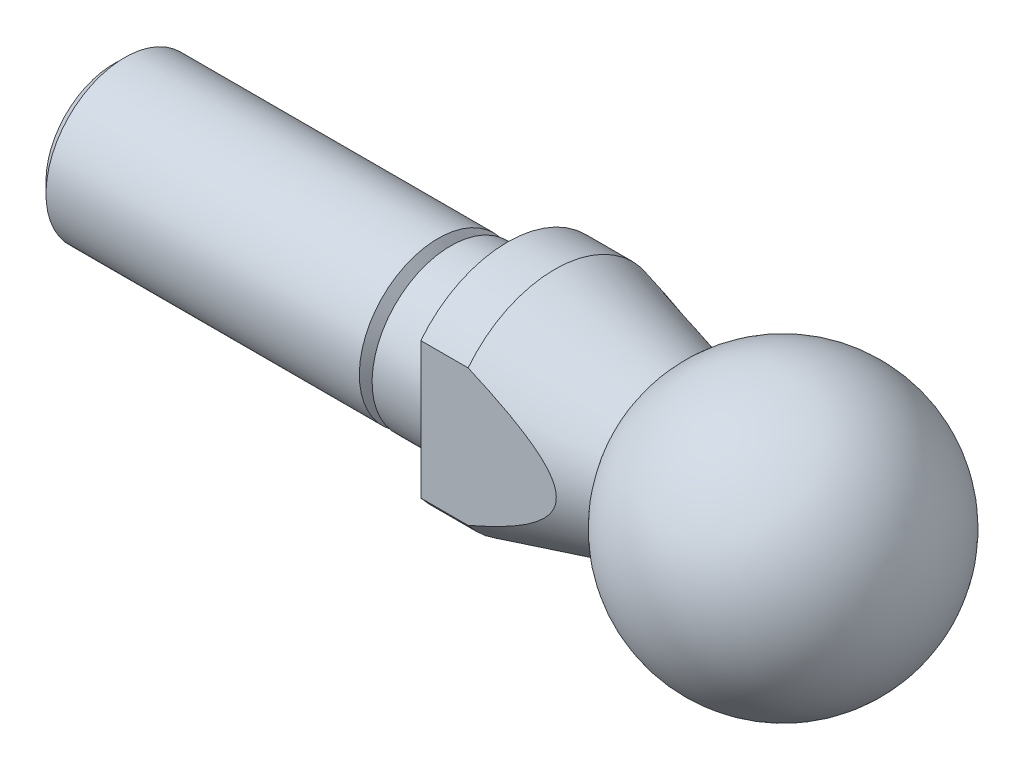
ISO-10303-21;
HEADER;
FILE_DESCRIPTION(('STEP AP214'),'2;1');
FILE_NAME('part.step','',(''),(''),'','','');
FILE_SCHEMA(('AUTOMOTIVE_DESIGN { 1 0 10303 214 1 1 1 1 }'));
ENDSEC;
DATA;
#1=APPLICATION_CONTEXT('core data for automotive mechanical design processes');
#2=APPLICATION_PROTOCOL_DEFINITION('international standard','automotive_design',2000,#1);
#3=PRODUCT_CONTEXT('',#1,'mechanical');
#4=PRODUCT('Part','Part','',(#3));
#5=PRODUCT_RELATED_PRODUCT_CATEGORY('part','',(#4));
#6=PRODUCT_DEFINITION_FORMATION('','',#4);
#7=PRODUCT_DEFINITION_CONTEXT('part definition',#1,'design');
#8=PRODUCT_DEFINITION('design','',#6,#7);
#9=PRODUCT_DEFINITION_SHAPE('','',#8);
#10=(LENGTH_UNIT() NAMED_UNIT(*) SI_UNIT(.MILLI.,.METRE.));
#11=(NAMED_UNIT(*) PLANE_ANGLE_UNIT() SI_UNIT($,.RADIAN.));
#12=(NAMED_UNIT(*) SI_UNIT($,.STERADIAN.) SOLID_ANGLE_UNIT());
#13=UNCERTAINTY_MEASURE_WITH_UNIT(LENGTH_MEASURE(1.E-05),#10,'distance_accuracy_value','');
#14=(GEOMETRIC_REPRESENTATION_CONTEXT(3) GLOBAL_UNCERTAINTY_ASSIGNED_CONTEXT((#13)) GLOBAL_UNIT_ASSIGNED_CONTEXT((#10,
#11,#12)) REPRESENTATION_CONTEXT('',''));
#15=CARTESIAN_POINT('',(0.,0.,0.));
#16=DIRECTION('',(0.,0.,1.));
#17=DIRECTION('',(1.,0.,0.));
#18=AXIS2_PLACEMENT_3D('',#15,#16,#17);
#19=CARTESIAN_POINT('',(-7.15784102046485,0.,0.));
#20=DIRECTION('',(-1.,0.,0.));
#21=DIRECTION('',(0.,-1.,0.));
#22=AXIS2_PLACEMENT_3D('',#19,#20,#21);
#23=CONICAL_SURFACE('',#22,5.03267443073269,0.261799387799143);
#24=CARTESIAN_POINT('',(-7.15784102046485,0.,0.));
#25=DIRECTION('',(-1.,0.,0.));
#26=DIRECTION('',(0.,-1.,0.));
#27=AXIS2_PLACEMENT_3D('',#24,#25,#26);
#28=CIRCLE('',#27,5.03267443073269);
#29=CARTESIAN_POINT('',(-7.15784102046485,-5.03267443073269,0.));
#30=VERTEX_POINT('',#29);
#31=EDGE_CURVE('E89',#30,#30,#28,.T.);
#32=ORIENTED_EDGE('',*,*,#31,.T.);
#33=EDGE_LOOP('',(#32));
#34=FACE_BOUND('',#33,.T.);
#35=CARTESIAN_POINT('',(-30.3086565496056,-9.7977459318579,5.5));
#36=CARTESIAN_POINT('',(-29.6572733564107,-9.59755580635371,5.5));
#37=CARTESIAN_POINT('',(-29.0062819363358,-9.39607938292667,5.5));
#38=CARTESIAN_POINT('',(-27.7052564749515,-8.98986114258725,5.5));
#39=CARTESIAN_POINT('',(-27.0552225228895,-8.78511904001088,5.5));
#40=CARTESIAN_POINT('',(-25.7533359999431,-8.3707362104608,5.5));
#41=CARTESIAN_POINT('',(-25.1014893221234,-8.16107692658439,5.5));
#42=CARTESIAN_POINT('',(-23.799451161882,-7.73682458402449,5.5));
#43=CARTESIAN_POINT('',(-23.1492595711958,-7.52223185777087,5.5));
#44=CARTESIAN_POINT('',(-21.7341338990989,-7.04760138951555,5.5));
#45=CARTESIAN_POINT('',(-20.9696089970535,-6.78633544809235,5.5));
#46=CARTESIAN_POINT('',(-19.8258981480734,-6.38536345586967,5.5));
#47=CARTESIAN_POINT('',(-19.4451276461648,-6.25017688510703,5.5));
#48=CARTESIAN_POINT('',(-18.6848985052808,-5.97616836588721,5.5));
#49=CARTESIAN_POINT('',(-18.3054398522372,-5.83734645655277,5.5));
#50=CARTESIAN_POINT('',(-17.5493340310696,-5.55572393081798,5.5));
#51=CARTESIAN_POINT('',(-17.172681797699,-5.41293694311487,5.5));
#52=CARTESIAN_POINT('',(-16.4214832528,-5.12193119902634,5.5));
#53=CARTESIAN_POINT('',(-16.0469368935971,-4.97371256618267,5.5));
#54=CARTESIAN_POINT('',(-15.3007840511043,-4.67044043180432,5.5));
#55=CARTESIAN_POINT('',(-14.9291764745641,-4.51538962804139,5.5));
#56=CARTESIAN_POINT('',(-14.1898430093052,-4.19632489403113,5.5));
#57=CARTESIAN_POINT('',(-13.8221166448905,-4.03231207778701,5.5));
#58=CARTESIAN_POINT('',(-13.2847752326486,-3.78175291075826,5.5));
#59=CARTESIAN_POINT('',(-13.1129421773135,-3.69996224203946,5.5));
#60=CARTESIAN_POINT('',(-12.7708422708496,-3.53312532321585,5.5));
#61=CARTESIAN_POINT('',(-12.6005755387882,-3.44807882810782,5.5));
#62=CARTESIAN_POINT('',(-12.261434471099,-3.27380954059523,5.5));
#63=CARTESIAN_POINT('',(-12.0925670694771,-3.18457320784866,5.5));
#64=CARTESIAN_POINT('',(-11.7574359359676,-3.00137672886827,5.5));
#65=CARTESIAN_POINT('',(-11.5911717875321,-2.90741734871449,5.5));
#66=CARTESIAN_POINT('',(-11.2660941217062,-2.71599680943488,5.5));
#67=CARTESIAN_POINT('',(-11.1071977963383,-2.6186770382101,5.5));
#68=CARTESIAN_POINT('',(-10.7939298291646,-2.41702413012211,5.5));
#69=CARTESIAN_POINT('',(-10.6395569882404,-2.31269287651365,5.5));
#70=CARTESIAN_POINT('',(-10.3380392975269,-2.09548825687512,5.5));
#71=CARTESIAN_POINT('',(-10.1908627840656,-1.98265917356942,5.5));
#72=CARTESIAN_POINT('',(-9.90642369636896,-1.74523475105991,5.5));
#73=CARTESIAN_POINT('',(-9.76914428703038,-1.62066026611352,5.5));
#74=CARTESIAN_POINT('',(-9.58621031210486,-1.43293812631534,5.5));
#75=CARTESIAN_POINT('',(-9.53382540713891,-1.37635341320456,5.5));
#76=CARTESIAN_POINT('',(-9.43261693746764,-1.26000803273447,5.5));
#77=CARTESIAN_POINT('',(-9.38379514709474,-1.20024580832253,5.5));
#78=CARTESIAN_POINT('',(-9.29091518040912,-1.07749084427147,5.5));
#79=CARTESIAN_POINT('',(-9.24683771064107,-1.01451285357269,5.5));
#80=CARTESIAN_POINT('',(-9.16452174172831,-0.884884169084483,5.5));
#81=CARTESIAN_POINT('',(-9.12627882113405,-0.818236308991697,5.5));
#82=CARTESIAN_POINT('',(-9.0503722672592,-0.667625902735432,5.5));
#83=CARTESIAN_POINT('',(-9.0143032613474,-0.582836809450138,5.5));
#84=CARTESIAN_POINT('',(-8.95593854850011,-0.40855730220267,5.5));
#85=CARTESIAN_POINT('',(-8.93363615913501,-0.319069192108331,5.5));
#86=CARTESIAN_POINT('',(-8.9054364550181,-0.136712103098372,5.5));
#87=CARTESIAN_POINT('',(-8.89967122644548,-0.0438218722298911,5.5));
#88=CARTESIAN_POINT('',(-8.90578956140303,0.141340455610233,5.5));
#89=CARTESIAN_POINT('',(-8.91767233433567,0.233612580085878,5.5));
#90=CARTESIAN_POINT('',(-8.95967790771288,0.425015201553311,5.5));
#91=CARTESIAN_POINT('',(-8.99175027563972,0.52370563448707,5.5));
#92=CARTESIAN_POINT('',(-9.07141162369205,0.714622086749631,5.5));
#93=CARTESIAN_POINT('',(-9.11903488408738,0.806833272530196,5.5));
#94=CARTESIAN_POINT('',(-9.21718799776046,0.970475312071337,5.5));
#95=CARTESIAN_POINT('',(-9.26610217314346,1.04290236427465,5.5));
#96=CARTESIAN_POINT('',(-9.37002435087548,1.18328701857636,5.5));
#97=CARTESIAN_POINT('',(-9.42503714354686,1.2512410394826,5.5));
#98=CARTESIAN_POINT('',(-9.53980469810965,1.38327977577842,5.5));
#99=CARTESIAN_POINT('',(-9.59957117513715,1.44735420067569,5.5));
#100=CARTESIAN_POINT('',(-9.7226422030175,1.57193551276689,5.5));
#101=CARTESIAN_POINT('',(-9.78594548848757,1.63244366016623,5.5));
#102=CARTESIAN_POINT('',(-9.95673814997246,1.7881444264261,5.5));
#103=CARTESIAN_POINT('',(-10.0665789595765,1.88075255012827,5.5));
#104=CARTESIAN_POINT('',(-10.2914780229694,2.05944601323528,5.5));
#105=CARTESIAN_POINT('',(-10.4065395158708,2.1455272121265,5.5));
#106=CARTESIAN_POINT('',(-10.6406627748794,2.3125496624972,5.5));
#107=CARTESIAN_POINT('',(-10.7597321247345,2.39348022240775,5.5));
#108=CARTESIAN_POINT('',(-11.0007242029688,2.55098166144038,5.5));
#109=CARTESIAN_POINT('',(-11.1226472936136,2.6275519827743,5.5));
#110=CARTESIAN_POINT('',(-11.3694170038831,2.77749508225398,5.5));
#111=CARTESIAN_POINT('',(-11.4942765899279,2.850846434877,5.5));
#112=CARTESIAN_POINT('',(-11.7457674395737,2.99445019364675,5.5));
#113=CARTESIAN_POINT('',(-11.8723987919946,3.06470244369486,5.5));
#114=CARTESIAN_POINT('',(-12.1269114636155,3.20246220196739,5.5));
#115=CARTESIAN_POINT('',(-12.2547907692149,3.26997343964527,5.5));
#116=CARTESIAN_POINT('',(-12.5117209633782,3.40270958462762,5.5));
#117=CARTESIAN_POINT('',(-12.640771807392,3.46793457841644,5.5));
#118=CARTESIAN_POINT('',(-13.0774345753142,3.68447276144217,5.5));
#119=CARTESIAN_POINT('',(-13.3873099377228,3.83122676400763,5.5));
#120=CARTESIAN_POINT('',(-14.0108447982016,4.11649340264011,5.5));
#121=CARTESIAN_POINT('',(-14.3245048392076,4.25500483893844,5.5));
#122=CARTESIAN_POINT('',(-14.9547084323682,4.52567944277061,5.5));
#123=CARTESIAN_POINT('',(-15.2712531991845,4.65783977376475,5.5));
#124=CARTESIAN_POINT('',(-15.9064263359777,4.91705919299008,5.5));
#125=CARTESIAN_POINT('',(-16.2250547621932,5.04411814286714,5.5));
#126=CARTESIAN_POINT('',(-16.8645407615248,5.29431950192194,5.5));
#127=CARTESIAN_POINT('',(-17.1854014214755,5.41745400362275,5.5));
#128=CARTESIAN_POINT('',(-17.8284299419221,5.66026458891446,5.5));
#129=CARTESIAN_POINT('',(-18.1505978182336,5.77994063051939,5.5));
#130=CARTESIAN_POINT('',(-19.1185091852261,6.13456987519592,5.5));
#131=CARTESIAN_POINT('',(-19.7658390128244,6.36519328443086,5.5));
#132=CARTESIAN_POINT('',(-21.0617948525366,6.81743160807604,5.5));
#133=CARTESIAN_POINT('',(-21.7104135226176,7.03906769875516,5.5));
#134=CARTESIAN_POINT('',(-23.0098457403993,7.47593660106778,5.5));
#135=CARTESIAN_POINT('',(-23.6606594254715,7.69116900333516,5.5));
#136=CARTESIAN_POINT('',(-24.9633835769161,8.11642592215986,5.5));
#137=CARTESIAN_POINT('',(-25.6152926822384,8.32645461828072,5.5));
#138=CARTESIAN_POINT('',(-26.9203953352244,8.74248224444542,5.5));
#139=CARTESIAN_POINT('',(-27.5735888849695,8.94848116795294,5.5));
#140=CARTESIAN_POINT('',(-28.4006105287529,9.20701088497421,5.5));
#141=CARTESIAN_POINT('',(-28.573961109195,9.26107373452961,5.5));
#142=CARTESIAN_POINT('',(-28.9207445545727,9.368982518477,5.5));
#143=CARTESIAN_POINT('',(-29.0941774248434,9.42282843573616,5.5));
#144=CARTESIAN_POINT('',(-29.4410890337542,9.53030427317599,5.5));
#145=CARTESIAN_POINT('',(-29.6145677651988,9.58393421658966,5.5));
#146=CARTESIAN_POINT('',(-29.9615734427521,9.69098978271579,5.5));
#147=CARTESIAN_POINT('',(-30.1351003840442,9.74441542104003,5.5));
#148=CARTESIAN_POINT('',(-30.3086565496056,9.79774593185789,5.5));
#149=B_SPLINE_CURVE_WITH_KNOTS('',3,(#35,#36,#37,#38,#39,#40,#41,#42,#43,#44,#45,#46,#47,#48,
#49,#50,#51,#52,#53,#54,#55,#56,#57,#58,#59,#60,#61,#62,#63,#64,#65,#66,#67,#68,#69,#70,#71,#72,
#73,#74,#75,#76,#77,#78,#79,#80,#81,#82,#83,#84,#85,#86,#87,#88,#89,#90,#91,#92,#93,#94,#95,#96,
#97,#98,#99,#100,#101,#102,#103,#104,#105,#106,#107,#108,#109,#110,#111,#112,#113,#114,#115,
#116,#117,#118,#119,#120,#121,#122,#123,#124,#125,#126,#127,#128,#129,#130,#131,#132,#133,#134,
#135,#136,#137,#138,#139,#140,#141,#142,#143,#144,#145,#146,#147,#148),.UNSPECIFIED.,.F.,.F.,(4,
2,2,2,2,2,2,2,2,2,2,2,2,2,2,2,2,2,2,2,2,2,2,2,2,2,2,2,2,2,2,2,2,2,2,2,2,2,2,2,2,2,2,2,2,2,2,2,2,
2,2,2,2,2,2,2,4),(0.,2.04435810167455,4.08889602433367,6.14308190645711,8.19712977485369,
10.620848071053,11.8330032557098,13.0451454007652,14.2535397694165,15.4619066704013,
16.6698006343218,17.8775447936978,18.4484358689222,19.0193699888728,19.5922968185854,
20.165131017344,20.7239877189914,21.2826949094174,21.8386690275502,22.3936739505144,
22.6248907483618,22.856221911071,23.0865736426456,23.3167499361072,23.592217062284,
23.8675503690713,24.1450767856332,24.4225907699046,24.7321820403902,25.0424604314497,
25.304277964504,25.5663026261202,25.8289943251117,26.0915926339591,26.522244156468,
26.9531666264198,27.3849562322125,27.8168009516298,28.2511824514274,28.6855858056515,
29.1193768155848,29.5531513982671,30.5815679369878,31.6101338052974,32.6391548631809,
33.6682038102341,34.6992096733585,35.7302280477221,37.7916904052543,39.847973792437,
41.9043883496421,43.9590938391134,46.0138026610577,46.5585584849971,47.1033565207141,
47.6480942954206,48.1927895776807),.UNSPECIFIED.);
#150=CARTESIAN_POINT('',(-14.5,-4.3301270189222,5.5));
#151=VERTEX_POINT('',#150);
#152=CARTESIAN_POINT('',(-14.5,4.33012701892219,5.5));
#153=VERTEX_POINT('',#152);
#154=EDGE_CURVE('E115',#151,#153,#149,.T.);
#155=ORIENTED_EDGE('',*,*,#154,.F.);
#156=CARTESIAN_POINT('',(-14.5,0.,0.));
#157=DIRECTION('',(-1.,0.,0.));
#158=DIRECTION('',(0.,-1.,0.));
#159=AXIS2_PLACEMENT_3D('',#156,#157,#158);
#160=CIRCLE('',#159,7.);
#161=CARTESIAN_POINT('',(-14.5,-4.3301270189222,-5.5));
#162=VERTEX_POINT('',#161);
#163=EDGE_CURVE('E140',#162,#151,#160,.T.);
#164=ORIENTED_EDGE('',*,*,#163,.F.);
#165=CARTESIAN_POINT('',(-30.3086565496056,9.79774593185789,-5.5));
#166=CARTESIAN_POINT('',(-29.6572733564107,9.59755580635371,-5.5));
#167=CARTESIAN_POINT('',(-29.0062819363358,9.39607938292666,-5.5));
#168=CARTESIAN_POINT('',(-27.7052564749515,8.98986114258725,-5.5));
#169=CARTESIAN_POINT('',(-27.0552225228895,8.78511904001087,-5.5));
#170=CARTESIAN_POINT('',(-25.7533359999431,8.3707362104608,-5.5));
#171=CARTESIAN_POINT('',(-25.1014893221234,8.16107692658439,-5.5));
#172=CARTESIAN_POINT('',(-23.799451161882,7.73682458402449,-5.5));
#173=CARTESIAN_POINT('',(-23.1492595711958,7.52223185777087,-5.5));
#174=CARTESIAN_POINT('',(-21.7341338990989,7.04760138951556,-5.5));
#175=CARTESIAN_POINT('',(-20.9696089970535,6.78633544809235,-5.5));
#176=CARTESIAN_POINT('',(-19.8258981480734,6.38536345586967,-5.5));
#177=CARTESIAN_POINT('',(-19.4451276461648,6.25017688510703,-5.5));
#178=CARTESIAN_POINT('',(-18.6848985052808,5.97616836588721,-5.5));
#179=CARTESIAN_POINT('',(-18.3054398522372,5.83734645655278,-5.5));
#180=CARTESIAN_POINT('',(-17.5493340310696,5.55572393081798,-5.5));
#181=CARTESIAN_POINT('',(-17.172681797699,5.41293694311488,-5.5));
#182=CARTESIAN_POINT('',(-16.4214832528,5.12193119902634,-5.5));
#183=CARTESIAN_POINT('',(-16.0469368935971,4.97371256618267,-5.5));
#184=CARTESIAN_POINT('',(-15.3007840511043,4.67044043180432,-5.5));
#185=CARTESIAN_POINT('',(-14.9291764745641,4.51538962804139,-5.5));
#186=CARTESIAN_POINT('',(-14.1898430093052,4.19632489403113,-5.5));
#187=CARTESIAN_POINT('',(-13.8221166448905,4.03231207778701,-5.5));
#188=CARTESIAN_POINT('',(-13.2847752326486,3.78175291075826,-5.5));
#189=CARTESIAN_POINT('',(-13.1129421773135,3.69996224203946,-5.5));
#190=CARTESIAN_POINT('',(-12.7708422708496,3.53312532321585,-5.5));
#191=CARTESIAN_POINT('',(-12.6005755387882,3.44807882810781,-5.5));
#192=CARTESIAN_POINT('',(-12.261434471099,3.27380954059523,-5.5));
#193=CARTESIAN_POINT('',(-12.0925670694771,3.18457320784866,-5.5));
#194=CARTESIAN_POINT('',(-11.7574359359676,3.00137672886827,-5.5));
#195=CARTESIAN_POINT('',(-11.5911717875321,2.90741734871449,-5.5));
#196=CARTESIAN_POINT('',(-11.2660941217062,2.71599680943488,-5.5));
#197=CARTESIAN_POINT('',(-11.1071977963383,2.61867703821009,-5.5));
#198=CARTESIAN_POINT('',(-10.7939298291646,2.4170241301221,-5.5));
#199=CARTESIAN_POINT('',(-10.6395569882404,2.31269287651365,-5.5));
#200=CARTESIAN_POINT('',(-10.3380392975269,2.09548825687513,-5.5));
#201=CARTESIAN_POINT('',(-10.1908627840656,1.98265917356942,-5.5));
#202=CARTESIAN_POINT('',(-9.90642369636897,1.74523475105992,-5.5));
#203=CARTESIAN_POINT('',(-9.76914428703038,1.62066026611352,-5.5));
#204=CARTESIAN_POINT('',(-9.58621031210487,1.43293812631534,-5.5));
#205=CARTESIAN_POINT('',(-9.53382540713892,1.37635341320456,-5.5));
#206=CARTESIAN_POINT('',(-9.43261693746765,1.26000803273447,-5.5));
#207=CARTESIAN_POINT('',(-9.38379514709475,1.20024580832254,-5.5));
#208=CARTESIAN_POINT('',(-9.29091518040912,1.07749084427147,-5.5));
#209=CARTESIAN_POINT('',(-9.24683771064107,1.01451285357269,-5.5));
#210=CARTESIAN_POINT('',(-9.16452174172831,0.884884169084487,-5.5));
#211=CARTESIAN_POINT('',(-9.12627882113405,0.818236308991701,-5.5));
#212=CARTESIAN_POINT('',(-9.0503722672592,0.667625902735436,-5.5));
#213=CARTESIAN_POINT('',(-9.0143032613474,0.582836809450142,-5.5));
#214=CARTESIAN_POINT('',(-8.95593854850011,0.408557302202674,-5.5));
#215=CARTESIAN_POINT('',(-8.93363615913501,0.319069192108335,-5.5));
#216=CARTESIAN_POINT('',(-8.9054364550181,0.136712103098377,-5.5));
#217=CARTESIAN_POINT('',(-8.89967122644548,0.0438218722298964,-5.5));
#218=CARTESIAN_POINT('',(-8.90578956140303,-0.141340455610228,-5.5));
#219=CARTESIAN_POINT('',(-8.91767233433567,-0.233612580085875,-5.5));
#220=CARTESIAN_POINT('',(-8.95967790771288,-0.425015201553307,-5.5));
#221=CARTESIAN_POINT('',(-8.99175027563972,-0.523705634487065,-5.5));
#222=CARTESIAN_POINT('',(-9.07141162369205,-0.714622086749626,-5.5));
#223=CARTESIAN_POINT('',(-9.11903488408737,-0.806833272530192,-5.5));
#224=CARTESIAN_POINT('',(-9.21718799776045,-0.970475312071335,-5.5));
#225=CARTESIAN_POINT('',(-9.26610217314346,-1.04290236427465,-5.5));
#226=CARTESIAN_POINT('',(-9.37002435087547,-1.18328701857636,-5.5));
#227=CARTESIAN_POINT('',(-9.42503714354686,-1.2512410394826,-5.5));
#228=CARTESIAN_POINT('',(-9.53980469810964,-1.38327977577842,-5.5));
#229=CARTESIAN_POINT('',(-9.59957117513715,-1.44735420067569,-5.5));
#230=CARTESIAN_POINT('',(-9.7226422030175,-1.57193551276688,-5.5));
#231=CARTESIAN_POINT('',(-9.78594548848756,-1.63244366016623,-5.5));
#232=CARTESIAN_POINT('',(-9.95673814997245,-1.7881444264261,-5.5));
#233=CARTESIAN_POINT('',(-10.0665789595765,-1.88075255012827,-5.5));
#234=CARTESIAN_POINT('',(-10.2914780229694,-2.05944601323527,-5.5));
#235=CARTESIAN_POINT('',(-10.4065395158708,-2.1455272121265,-5.5));
#236=CARTESIAN_POINT('',(-10.6406627748794,-2.3125496624972,-5.5));
#237=CARTESIAN_POINT('',(-10.7597321247344,-2.39348022240775,-5.5));
#238=CARTESIAN_POINT('',(-11.0007242029688,-2.55098166144038,-5.5));
#239=CARTESIAN_POINT('',(-11.1226472936136,-2.6275519827743,-5.5));
#240=CARTESIAN_POINT('',(-11.3694170038831,-2.77749508225397,-5.5));
#241=CARTESIAN_POINT('',(-11.4942765899279,-2.850846434877,-5.5));
#242=CARTESIAN_POINT('',(-11.7457674395737,-2.99445019364675,-5.5));
#243=CARTESIAN_POINT('',(-11.8723987919946,-3.06470244369486,-5.5));
#244=CARTESIAN_POINT('',(-12.1269114636155,-3.20246220196738,-5.5));
#245=CARTESIAN_POINT('',(-12.2547907692149,-3.26997343964526,-5.5));
#246=CARTESIAN_POINT('',(-12.5117209633782,-3.40270958462762,-5.5));
#247=CARTESIAN_POINT('',(-12.640771807392,-3.46793457841643,-5.5));
#248=CARTESIAN_POINT('',(-13.0774345753141,-3.68447276144217,-5.5));
#249=CARTESIAN_POINT('',(-13.3873099377228,-3.83122676400763,-5.5));
#250=CARTESIAN_POINT('',(-14.0108447982015,-4.1164934026401,-5.5));
#251=CARTESIAN_POINT('',(-14.3245048392076,-4.25500483893843,-5.5));
#252=CARTESIAN_POINT('',(-14.9547084323682,-4.52567944277061,-5.5));
#253=CARTESIAN_POINT('',(-15.2712531991845,-4.65783977376474,-5.5));
#254=CARTESIAN_POINT('',(-15.9064263359777,-4.91705919299008,-5.5));
#255=CARTESIAN_POINT('',(-16.2250547621932,-5.04411814286714,-5.5));
#256=CARTESIAN_POINT('',(-16.8645407615247,-5.29431950192194,-5.5));
#257=CARTESIAN_POINT('',(-17.1854014214755,-5.41745400362275,-5.5));
#258=CARTESIAN_POINT('',(-17.8284299419221,-5.66026458891446,-5.5));
#259=CARTESIAN_POINT('',(-18.1505978182336,-5.77994063051938,-5.5));
#260=CARTESIAN_POINT('',(-19.1185091852261,-6.13456987519592,-5.5));
#261=CARTESIAN_POINT('',(-19.7658390128244,-6.36519328443085,-5.5));
#262=CARTESIAN_POINT('',(-21.0617948525366,-6.81743160807603,-5.5));
#263=CARTESIAN_POINT('',(-21.7104135226176,-7.03906769875515,-5.5));
#264=CARTESIAN_POINT('',(-23.0098457403992,-7.47593660106778,-5.5));
#265=CARTESIAN_POINT('',(-23.6606594254714,-7.69116900333516,-5.5));
#266=CARTESIAN_POINT('',(-24.9633835769161,-8.11642592215986,-5.5));
#267=CARTESIAN_POINT('',(-25.6152926822384,-8.32645461828071,-5.5));
#268=CARTESIAN_POINT('',(-26.9203953352243,-8.74248224444541,-5.5));
#269=CARTESIAN_POINT('',(-27.5735888849695,-8.94848116795294,-5.5));
#270=CARTESIAN_POINT('',(-28.4006105287528,-9.2070108849742,-5.5));
#271=CARTESIAN_POINT('',(-28.573961109195,-9.2610737345296,-5.5));
#272=CARTESIAN_POINT('',(-28.9207445545727,-9.368982518477,-5.5));
#273=CARTESIAN_POINT('',(-29.0941774248434,-9.42282843573616,-5.5));
#274=CARTESIAN_POINT('',(-29.4410890337542,-9.53030427317599,-5.5));
#275=CARTESIAN_POINT('',(-29.6145677651988,-9.58393421658966,-5.5));
#276=CARTESIAN_POINT('',(-29.9615734427521,-9.6909897827158,-5.5));
#277=CARTESIAN_POINT('',(-30.1351003840442,-9.74441542104004,-5.5));
#278=CARTESIAN_POINT('',(-30.3086565496056,-9.7977459318579,-5.5));
#279=B_SPLINE_CURVE_WITH_KNOTS('',3,(#165,#166,#167,#168,#169,#170,#171,#172,#173,#174,#175,
#176,#177,#178,#179,#180,#181,#182,#183,#184,#185,#186,#187,#188,#189,#190,#191,#192,#193,#194,
#195,#196,#197,#198,#199,#200,#201,#202,#203,#204,#205,#206,#207,#208,#209,#210,#211,#212,#213,
#214,#215,#216,#217,#218,#219,#220,#221,#222,#223,#224,#225,#226,#227,#228,#229,#230,#231,#232,
#233,#234,#235,#236,#237,#238,#239,#240,#241,#242,#243,#244,#245,#246,#247,#248,#249,#250,#251,
#252,#253,#254,#255,#256,#257,#258,#259,#260,#261,#262,#263,#264,#265,#266,#267,#268,#269,#270,
#271,#272,#273,#274,#275,#276,#277,#278),.UNSPECIFIED.,.F.,.F.,(4,2,2,2,2,2,2,2,2,2,2,2,2,2,2,2,
2,2,2,2,2,2,2,2,2,2,2,2,2,2,2,2,2,2,2,2,2,2,2,2,2,2,2,2,2,2,2,2,2,2,2,2,2,2,2,2,4),(0.,
2.04435810167455,4.08889602433366,6.14308190645709,8.19712977485367,10.620848071053,
11.8330032557098,13.0451454007651,14.2535397694165,15.4619066704013,16.6698006343217,
17.8775447936978,18.4484358689222,19.0193699888728,19.5922968185854,20.165131017344,
20.7239877189914,21.2826949094174,21.8386690275502,22.3936739505144,22.6248907483618,
22.856221911071,23.0865736426455,23.3167499361072,23.592217062284,23.8675503690713,
24.1450767856332,24.4225907699046,24.7321820403902,25.0424604314497,25.304277964504,
25.5663026261202,25.8289943251117,26.0915926339591,26.522244156468,26.9531666264198,
27.3849562322125,27.8168009516298,28.2511824514274,28.6855858056515,29.1193768155848,
29.5531513982671,30.5815679369878,31.6101338052974,32.6391548631809,33.6682038102341,
34.6992096733585,35.7302280477221,37.7916904052543,39.8479737924369,41.9043883496421,
43.9590938391134,46.0138026610577,46.5585584849971,47.1033565207141,47.6480942954205,
48.1927895776807),.UNSPECIFIED.);
#280=CARTESIAN_POINT('',(-14.5,4.33012701892219,-5.5));
#281=VERTEX_POINT('',#280);
#282=EDGE_CURVE('E93',#281,#162,#279,.T.);
#283=ORIENTED_EDGE('',*,*,#282,.F.);
#284=EDGE_CURVE('E92',#153,#281,#160,.T.);
#285=ORIENTED_EDGE('',*,*,#284,.F.);
#286=EDGE_LOOP('',(#155,#164,#283,#285));
#287=FACE_BOUND('',#286,.T.);
#288=ADVANCED_FACE('F33',(#34,#287),#23,.T.);
#289=CARTESIAN_POINT('',(-9.81300364997102,0.,0.));
#290=DIRECTION('',(-1.,0.,0.));
#291=DIRECTION('',(0.,-1.,0.));
#292=AXIS2_PLACEMENT_3D('',#289,#290,#291);
#293=CYLINDRICAL_SURFACE('',#292,7.);
#294=DIRECTION('',(-1.,0.,0.));
#295=VECTOR('',#294,1.);
#296=CARTESIAN_POINT('',(-9.81300364997102,-4.3301270189222,-5.5));
#297=LINE('',#296,#295);
#298=CARTESIAN_POINT('',(-17.5,-4.3301270189222,-5.5));
#299=VERTEX_POINT('',#298);
#300=EDGE_CURVE('E88',#162,#299,#297,.T.);
#301=ORIENTED_EDGE('',*,*,#300,.F.);
#302=ORIENTED_EDGE('',*,*,#163,.T.);
#303=DIRECTION('',(-1.,0.,0.));
#304=VECTOR('',#303,1.);
#305=CARTESIAN_POINT('',(-9.81300364997102,-4.3301270189222,5.5));
#306=LINE('',#305,#304);
#307=CARTESIAN_POINT('',(-17.5,-4.3301270189222,5.5));
#308=VERTEX_POINT('',#307);
#309=EDGE_CURVE('E121',#308,#151,#306,.F.);
#310=ORIENTED_EDGE('',*,*,#309,.F.);
#311=CARTESIAN_POINT('',(-17.5,0.,0.));
#312=DIRECTION('',(-1.,0.,0.));
#313=DIRECTION('',(0.,-1.,0.));
#314=AXIS2_PLACEMENT_3D('',#311,#312,#313);
#315=CIRCLE('',#314,7.);
#316=EDGE_CURVE('E48',#299,#308,#315,.T.);
#317=ORIENTED_EDGE('',*,*,#316,.F.);
#318=EDGE_LOOP('',(#301,#302,#310,#317));
#319=FACE_BOUND('',#318,.T.);
#320=ADVANCED_FACE('F160',(#319),#293,.T.);
#321=DIRECTION('',(-1.,0.,0.));
#322=VECTOR('',#321,1.);
#323=CARTESIAN_POINT('',(-9.81300364997102,4.3301270189222,-5.5));
#324=LINE('',#323,#322);
#325=CARTESIAN_POINT('',(-17.5,4.3301270189222,-5.5));
#326=VERTEX_POINT('',#325);
#327=EDGE_CURVE('E86',#326,#281,#324,.F.);
#328=ORIENTED_EDGE('',*,*,#327,.F.);
#329=CARTESIAN_POINT('',(-17.5,4.3301270189222,5.5));
#330=VERTEX_POINT('',#329);
#331=EDGE_CURVE('E75',#330,#326,#315,.T.);
#332=ORIENTED_EDGE('',*,*,#331,.F.);
#333=DIRECTION('',(-1.,0.,0.));
#334=VECTOR('',#333,1.);
#335=CARTESIAN_POINT('',(-9.81300364997102,4.3301270189222,5.5));
#336=LINE('',#335,#334);
#337=EDGE_CURVE('E55',#153,#330,#336,.T.);
#338=ORIENTED_EDGE('',*,*,#337,.F.);
#339=ORIENTED_EDGE('',*,*,#284,.T.);
#340=EDGE_LOOP('',(#328,#332,#338,#339));
#341=FACE_BOUND('',#340,.T.);
#342=ADVANCED_FACE('F90',(#341),#293,.T.);
#343=CARTESIAN_POINT('',(-17.5,7.,0.));
#344=DIRECTION('',(1.,0.,0.));
#345=DIRECTION('',(0.,1.,0.));
#346=AXIS2_PLACEMENT_3D('',#343,#344,#345);
#347=PLANE('',#346);
#348=CARTESIAN_POINT('',(-17.5,0.,0.));
#349=DIRECTION('',(-1.,0.,0.));
#350=DIRECTION('',(0.,-1.,0.));
#351=AXIS2_PLACEMENT_3D('',#348,#349,#350);
#352=CIRCLE('',#351,5.);
#353=CARTESIAN_POINT('',(-17.5,-5.,0.));
#354=VERTEX_POINT('',#353);
#355=EDGE_CURVE('E80',#354,#354,#352,.T.);
#356=ORIENTED_EDGE('',*,*,#355,.F.);
#357=EDGE_LOOP('',(#356));
#358=FACE_BOUND('',#357,.T.);
#359=DIRECTION('',(0.,-1.,0.));
#360=VECTOR('',#359,1.);
#361=CARTESIAN_POINT('',(-17.5,7.,5.5));
#362=LINE('',#361,#360);
#363=EDGE_CURVE('E12',#330,#308,#362,.T.);
#364=ORIENTED_EDGE('',*,*,#363,.F.);
#365=ORIENTED_EDGE('',*,*,#331,.T.);
#366=DIRECTION('',(0.,1.,0.));
#367=VECTOR('',#366,1.);
#368=CARTESIAN_POINT('',(-17.5,7.,-5.5));
#369=LINE('',#368,#367);
#370=EDGE_CURVE('E41',#299,#326,#369,.T.);
#371=ORIENTED_EDGE('',*,*,#370,.F.);
#372=ORIENTED_EDGE('',*,*,#316,.T.);
#373=EDGE_LOOP('',(#364,#365,#371,#372));
#374=FACE_BOUND('',#373,.T.);
#375=ADVANCED_FACE('F77',(#358,#374),#347,.F.);
#376=CARTESIAN_POINT('',(0.,0.,0.));
#377=DIRECTION('',(-1.,0.,0.));
#378=DIRECTION('',(0.,-1.,0.));
#379=AXIS2_PLACEMENT_3D('',#376,#377,#378);
#380=SPHERICAL_SURFACE('',#379,8.75);
#381=ORIENTED_EDGE('',*,*,#31,.F.);
#382=EDGE_LOOP('',(#381));
#383=FACE_BOUND('',#382,.T.);
#384=ADVANCED_FACE('F35',(#383),#380,.T.);
#385=CARTESIAN_POINT('',(-9.81300364997102,0.,0.));
#386=DIRECTION('',(-1.,0.,0.));
#387=DIRECTION('',(0.,-1.,0.));
#388=AXIS2_PLACEMENT_3D('',#385,#386,#387);
#389=CYLINDRICAL_SURFACE('',#388,5.);
#390=CARTESIAN_POINT('',(-21.0958548115673,0.,0.));
#391=DIRECTION('',(-1.,0.,0.));
#392=DIRECTION('',(0.,-1.,0.));
#393=AXIS2_PLACEMENT_3D('',#390,#391,#392);
#394=CIRCLE('',#393,5.);
#395=CARTESIAN_POINT('',(-21.0958548115673,-5.,0.));
#396=VERTEX_POINT('',#395);
#397=EDGE_CURVE('E135',#396,#396,#394,.T.);
#398=ORIENTED_EDGE('',*,*,#397,.F.);
#399=EDGE_LOOP('',(#398));
#400=FACE_BOUND('',#399,.T.);
#401=ORIENTED_EDGE('',*,*,#355,.T.);
#402=EDGE_LOOP('',(#401));
#403=FACE_BOUND('',#402,.T.);
#404=ADVANCED_FACE('F149',(#400,#403),#389,.T.);
#405=CARTESIAN_POINT('',(-21.0958548115673,0.,0.));
#406=DIRECTION('',(1.,0.,0.));
#407=DIRECTION('',(0.,1.,0.));
#408=AXIS2_PLACEMENT_3D('',#405,#406,#407);
#409=CONICAL_SURFACE('',#408,5.,1.04719755119659);
#410=CARTESIAN_POINT('',(-21.5,0.,0.));
#411=DIRECTION('',(-1.,0.,0.));
#412=DIRECTION('',(0.,-1.,0.));
#413=AXIS2_PLACEMENT_3D('',#410,#411,#412);
#414=CIRCLE('',#413,4.3);
#415=CARTESIAN_POINT('',(-21.5,-4.3,0.));
#416=VERTEX_POINT('',#415);
#417=EDGE_CURVE('E132',#416,#416,#414,.T.);
#418=ORIENTED_EDGE('',*,*,#417,.F.);
#419=EDGE_LOOP('',(#418));
#420=FACE_BOUND('',#419,.T.);
#421=ORIENTED_EDGE('',*,*,#397,.T.);
#422=EDGE_LOOP('',(#421));
#423=FACE_BOUND('',#422,.T.);
#424=ADVANCED_FACE('F154',(#420,#423),#409,.T.);
#425=CARTESIAN_POINT('',(-21.5,0.,0.));
#426=DIRECTION('',(-1.,0.,0.));
#427=DIRECTION('',(0.,-1.,0.));
#428=AXIS2_PLACEMENT_3D('',#425,#426,#427);
#429=CONICAL_SURFACE('',#428,4.3,1.0471975511966);
#430=CARTESIAN_POINT('',(-21.9041451884327,0.,0.));
#431=DIRECTION('',(-1.,0.,0.));
#432=DIRECTION('',(0.,-1.,0.));
#433=AXIS2_PLACEMENT_3D('',#430,#431,#432);
#434=CIRCLE('',#433,5.);
#435=CARTESIAN_POINT('',(-21.9041451884327,-5.00000000000001,0.));
#436=VERTEX_POINT('',#435);
#437=EDGE_CURVE('E129',#436,#436,#434,.T.);
#438=ORIENTED_EDGE('',*,*,#437,.F.);
#439=EDGE_LOOP('',(#438));
#440=FACE_BOUND('',#439,.T.);
#441=ORIENTED_EDGE('',*,*,#417,.T.);
#442=EDGE_LOOP('',(#441));
#443=FACE_BOUND('',#442,.T.);
#444=ADVANCED_FACE('F170',(#440,#443),#429,.T.);
#445=CARTESIAN_POINT('',(-9.81300364997102,0.,0.));
#446=DIRECTION('',(-1.,0.,0.));
#447=DIRECTION('',(0.,-1.,0.));
#448=AXIS2_PLACEMENT_3D('',#445,#446,#447);
#449=CYLINDRICAL_SURFACE('',#448,5.);
#450=CARTESIAN_POINT('',(-41.8,0.,0.));
#451=DIRECTION('',(-1.,0.,0.));
#452=DIRECTION('',(0.,-1.,0.));
#453=AXIS2_PLACEMENT_3D('',#450,#451,#452);
#454=CIRCLE('',#453,5.);
#455=CARTESIAN_POINT('',(-41.8,-5.00000000000001,0.));
#456=VERTEX_POINT('',#455);
#457=EDGE_CURVE('E126',#456,#456,#454,.T.);
#458=ORIENTED_EDGE('',*,*,#457,.F.);
#459=EDGE_LOOP('',(#458));
#460=FACE_BOUND('',#459,.T.);
#461=ORIENTED_EDGE('',*,*,#437,.T.);
#462=EDGE_LOOP('',(#461));
#463=FACE_BOUND('',#462,.T.);
#464=ADVANCED_FACE('F174',(#460,#463),#449,.T.);
#465=CARTESIAN_POINT('',(-41.8,0.,0.));
#466=DIRECTION('',(1.,0.,0.));
#467=DIRECTION('',(0.,1.,0.));
#468=AXIS2_PLACEMENT_3D('',#465,#466,#467);
#469=CONICAL_SURFACE('',#468,5.,0.785398163397458);
#470=CARTESIAN_POINT('',(-42.5,0.,0.));
#471=DIRECTION('',(-1.,0.,0.));
#472=DIRECTION('',(0.,-1.,0.));
#473=AXIS2_PLACEMENT_3D('',#470,#471,#472);
#474=CIRCLE('',#473,4.30000000000001);
#475=CARTESIAN_POINT('',(-42.5,-4.30000000000001,0.));
#476=VERTEX_POINT('',#475);
#477=EDGE_CURVE('E123',#476,#476,#474,.T.);
#478=ORIENTED_EDGE('',*,*,#477,.F.);
#479=EDGE_LOOP('',(#478));
#480=FACE_BOUND('',#479,.T.);
#481=ORIENTED_EDGE('',*,*,#457,.T.);
#482=EDGE_LOOP('',(#481));
#483=FACE_BOUND('',#482,.T.);
#484=ADVANCED_FACE('F177',(#480,#483),#469,.T.);
#485=CARTESIAN_POINT('',(-42.5,4.3,0.));
#486=DIRECTION('',(1.,0.,0.));
#487=DIRECTION('',(0.,1.,0.));
#488=AXIS2_PLACEMENT_3D('',#485,#486,#487);
#489=PLANE('',#488);
#490=ORIENTED_EDGE('',*,*,#477,.T.);
#491=EDGE_LOOP('',(#490));
#492=FACE_BOUND('',#491,.T.);
#493=ADVANCED_FACE('F109',(#492),#489,.F.);
#494=CARTESIAN_POINT('',(17.8383836944796,-7.,-5.5));
#495=DIRECTION('',(0.,0.,-1.));
#496=DIRECTION('',(-1.,0.,0.));
#497=AXIS2_PLACEMENT_3D('',#494,#495,#496);
#498=PLANE('',#497);
#499=ORIENTED_EDGE('',*,*,#300,.T.);
#500=ORIENTED_EDGE('',*,*,#370,.T.);
#501=ORIENTED_EDGE('',*,*,#327,.T.);
#502=ORIENTED_EDGE('',*,*,#282,.T.);
#503=EDGE_LOOP('',(#499,#500,#501,#502));
#504=FACE_BOUND('',#503,.T.);
#505=ADVANCED_FACE('F84',(#504),#498,.T.);
#506=CARTESIAN_POINT('',(17.8383836944796,-7.,5.5));
#507=DIRECTION('',(0.,0.,1.));
#508=DIRECTION('',(1.,0.,0.));
#509=AXIS2_PLACEMENT_3D('',#506,#507,#508);
#510=PLANE('',#509);
#511=ORIENTED_EDGE('',*,*,#337,.T.);
#512=ORIENTED_EDGE('',*,*,#363,.T.);
#513=ORIENTED_EDGE('',*,*,#309,.T.);
#514=ORIENTED_EDGE('',*,*,#154,.T.);
#515=EDGE_LOOP('',(#511,#512,#513,#514));
#516=FACE_BOUND('',#515,.T.);
#517=ADVANCED_FACE('F108',(#516),#510,.T.);
#518=CLOSED_SHELL('',(#288,#320,#342,#375,#384,#404,#424,#444,#464,#484,#493,#505,#517));
#519=MANIFOLD_SOLID_BREP('B2',#518);
#520=ADVANCED_BREP_SHAPE_REPRESENTATION('',(#18,#519),#14);
#521=SHAPE_DEFINITION_REPRESENTATION(#9,#520);
ENDSEC;
END-ISO-10303-21;
